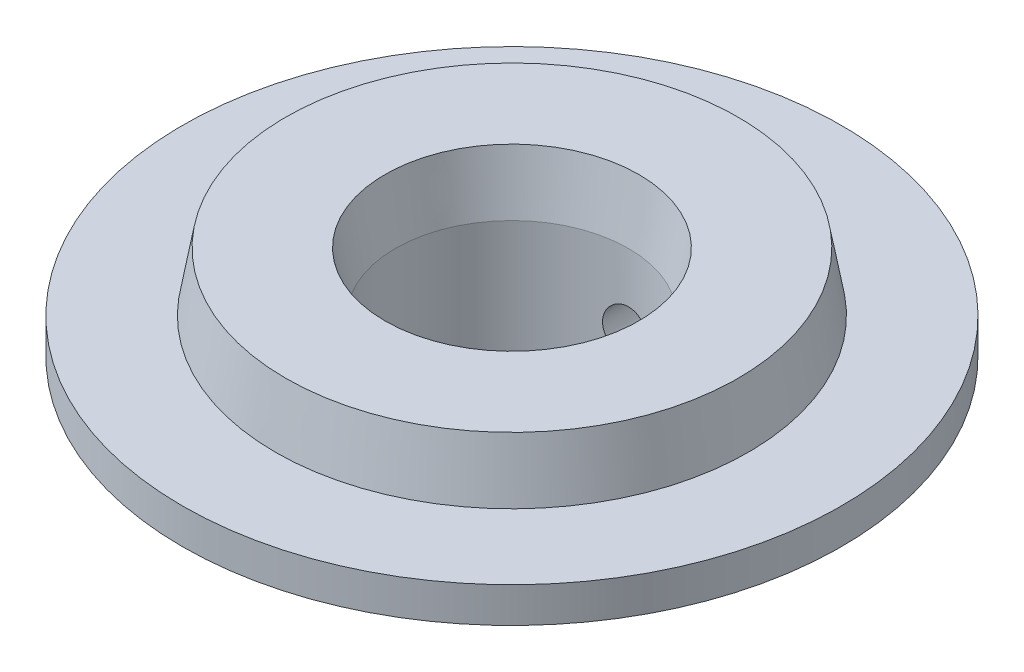
ISO-10303-21;
HEADER;
FILE_DESCRIPTION(('STEP AP214'),'2;1');
FILE_NAME('part.step','',(''),(''),'','','');
FILE_SCHEMA(('AUTOMOTIVE_DESIGN { 1 0 10303 214 1 1 1 1 }'));
ENDSEC;
DATA;
#1=APPLICATION_CONTEXT('core data for automotive mechanical design processes');
#2=APPLICATION_PROTOCOL_DEFINITION('international standard','automotive_design',2000,#1);
#3=PRODUCT_CONTEXT('',#1,'mechanical');
#4=PRODUCT('Part','Part','',(#3));
#5=PRODUCT_RELATED_PRODUCT_CATEGORY('part','',(#4));
#6=PRODUCT_DEFINITION_FORMATION('','',#4);
#7=PRODUCT_DEFINITION_CONTEXT('part definition',#1,'design');
#8=PRODUCT_DEFINITION('design','',#6,#7);
#9=PRODUCT_DEFINITION_SHAPE('','',#8);
#10=(LENGTH_UNIT() NAMED_UNIT(*) SI_UNIT(.MILLI.,.METRE.));
#11=(NAMED_UNIT(*) PLANE_ANGLE_UNIT() SI_UNIT($,.RADIAN.));
#12=(NAMED_UNIT(*) SI_UNIT($,.STERADIAN.) SOLID_ANGLE_UNIT());
#13=UNCERTAINTY_MEASURE_WITH_UNIT(LENGTH_MEASURE(1.E-05),#10,'distance_accuracy_value','');
#14=(GEOMETRIC_REPRESENTATION_CONTEXT(3) GLOBAL_UNCERTAINTY_ASSIGNED_CONTEXT((#13)) GLOBAL_UNIT_ASSIGNED_CONTEXT((#10,
#11,#12)) REPRESENTATION_CONTEXT('',''));
#15=CARTESIAN_POINT('',(0.,0.,0.));
#16=DIRECTION('',(0.,0.,1.));
#17=DIRECTION('',(1.,0.,0.));
#18=AXIS2_PLACEMENT_3D('',#15,#16,#17);
#19=CARTESIAN_POINT('',(0.,15.,0.));
#20=DIRECTION('',(0.,1.,0.));
#21=DIRECTION('',(0.,0.,1.));
#22=AXIS2_PLACEMENT_3D('',#19,#20,#21);
#23=PLANE('',#22);
#24=CARTESIAN_POINT('',(0.,15.,0.));
#25=DIRECTION('',(0.,1.,0.));
#26=DIRECTION('',(0.,0.,1.));
#27=AXIS2_PLACEMENT_3D('',#24,#25,#26);
#28=CIRCLE('',#27,19.2183650964577);
#29=CARTESIAN_POINT('',(0.,15.,19.2183650964577));
#30=VERTEX_POINT('',#29);
#31=EDGE_CURVE('E11',#30,#30,#28,.T.);
#32=ORIENTED_EDGE('',*,*,#31,.T.);
#33=EDGE_LOOP('',(#32));
#34=FACE_BOUND('',#33,.T.);
#35=CARTESIAN_POINT('',(0.,15.,0.));
#36=DIRECTION('',(0.,1.,0.));
#37=DIRECTION('',(0.,0.,1.));
#38=AXIS2_PLACEMENT_3D('',#35,#36,#37);
#39=CIRCLE('',#38,10.7816349035423);
#40=CARTESIAN_POINT('',(0.,15.,10.7816349035423));
#41=VERTEX_POINT('',#40);
#42=EDGE_CURVE('E45',#41,#41,#39,.T.);
#43=ORIENTED_EDGE('',*,*,#42,.F.);
#44=EDGE_LOOP('',(#43));
#45=FACE_BOUND('',#44,.T.);
#46=ADVANCED_FACE('F41',(#34,#45),#23,.T.);
#47=CARTESIAN_POINT('',(0.,10.,0.));
#48=DIRECTION('',(0.,1.,0.));
#49=DIRECTION('',(0.,0.,1.));
#50=AXIS2_PLACEMENT_3D('',#47,#48,#49);
#51=PLANE('',#50);
#52=CARTESIAN_POINT('',(0.,10.,0.));
#53=DIRECTION('',(0.,1.,0.));
#54=DIRECTION('',(0.,0.,1.));
#55=AXIS2_PLACEMENT_3D('',#52,#53,#54);
#56=CIRCLE('',#55,20.1);
#57=CARTESIAN_POINT('',(0.,10.,20.1));
#58=VERTEX_POINT('',#57);
#59=EDGE_CURVE('E49',#58,#58,#56,.T.);
#60=ORIENTED_EDGE('',*,*,#59,.F.);
#61=EDGE_LOOP('',(#60));
#62=FACE_BOUND('',#61,.T.);
#63=CARTESIAN_POINT('',(0.,10.,0.));
#64=DIRECTION('',(0.,1.,0.));
#65=DIRECTION('',(0.,0.,1.));
#66=AXIS2_PLACEMENT_3D('',#63,#64,#65);
#67=CIRCLE('',#66,9.9);
#68=CARTESIAN_POINT('',(0.,10.,9.9));
#69=VERTEX_POINT('',#68);
#70=EDGE_CURVE('E55',#69,#69,#67,.T.);
#71=ORIENTED_EDGE('',*,*,#70,.T.);
#72=EDGE_LOOP('',(#71));
#73=FACE_BOUND('',#72,.T.);
#74=ADVANCED_FACE('F65',(#62,#73),#51,.F.);
#75=CARTESIAN_POINT('',(0.,10.,0.));
#76=DIRECTION('',(0.,-1.,0.));
#77=DIRECTION('',(0.,0.,1.));
#78=AXIS2_PLACEMENT_3D('',#75,#76,#77);
#79=CONICAL_SURFACE('',#78,20.1,0.174532925199434);
#80=ORIENTED_EDGE('',*,*,#31,.F.);
#81=EDGE_LOOP('',(#80));
#82=FACE_BOUND('',#81,.T.);
#83=ORIENTED_EDGE('',*,*,#59,.T.);
#84=EDGE_LOOP('',(#83));
#85=FACE_BOUND('',#84,.T.);
#86=ADVANCED_FACE('F70',(#82,#85),#79,.T.);
#87=CARTESIAN_POINT('',(0.,10.,0.));
#88=DIRECTION('',(0.,1.,0.));
#89=DIRECTION('',(0.,0.,1.));
#90=AXIS2_PLACEMENT_3D('',#87,#88,#89);
#91=CONICAL_SURFACE('',#90,9.9,0.174532925199434);
#92=ORIENTED_EDGE('',*,*,#42,.T.);
#93=EDGE_LOOP('',(#92));
#94=FACE_BOUND('',#93,.T.);
#95=ORIENTED_EDGE('',*,*,#70,.F.);
#96=EDGE_LOOP('',(#95));
#97=FACE_BOUND('',#96,.T.);
#98=ADVANCED_FACE('F43',(#94,#97),#91,.F.);
#99=CLOSED_SHELL('',(#46,#74,#86,#98));
#100=MANIFOLD_SOLID_BREP('B2',#99);
#101=CARTESIAN_POINT('',(0.,7.,0.));
#102=DIRECTION('',(0.,-1.,0.));
#103=DIRECTION('',(0.,0.,-1.));
#104=AXIS2_PLACEMENT_3D('',#101,#102,#103);
#105=CYLINDRICAL_SURFACE('',#104,14.);
#106=CARTESIAN_POINT('',(0.,7.,0.));
#107=DIRECTION('',(0.,1.,0.));
#108=DIRECTION('',(0.,0.,1.));
#109=AXIS2_PLACEMENT_3D('',#106,#107,#108);
#110=CIRCLE('',#109,14.);
#111=CARTESIAN_POINT('',(0.,7.,14.));
#112=VERTEX_POINT('',#111);
#113=EDGE_CURVE('E40',#112,#112,#110,.T.);
#114=ORIENTED_EDGE('',*,*,#113,.F.);
#115=EDGE_LOOP('',(#114));
#116=FACE_BOUND('',#115,.T.);
#117=CARTESIAN_POINT('',(0.,0.,0.));
#118=DIRECTION('',(0.,1.,0.));
#119=DIRECTION('',(0.,0.,1.));
#120=AXIS2_PLACEMENT_3D('',#117,#118,#119);
#121=CIRCLE('',#120,14.);
#122=CARTESIAN_POINT('',(0.,0.,14.));
#123=VERTEX_POINT('',#122);
#124=EDGE_CURVE('E115',#123,#123,#121,.T.);
#125=ORIENTED_EDGE('',*,*,#124,.T.);
#126=EDGE_LOOP('',(#125));
#127=FACE_BOUND('',#126,.T.);
#128=CARTESIAN_POINT('',(-2.,3.70421529509385,13.856406460551));
#129=CARTESIAN_POINT('',(-1.99999534115949,3.59249112385413,13.8564082571265));
#130=CARTESIAN_POINT('',(-1.99060664506871,3.48070058232169,13.8577723197262));
#131=CARTESIAN_POINT('',(-1.95330740137887,3.26024065867055,13.8630779913067));
#132=CARTESIAN_POINT('',(-1.92537839621705,3.15157449957869,13.8670221688303));
#133=CARTESIAN_POINT('',(-1.85184738836467,2.94058659506499,13.8770324264324));
#134=CARTESIAN_POINT('',(-1.80625847122079,2.83826021699333,13.8830969350759));
#135=CARTESIAN_POINT('',(-1.69873175889211,2.64272556562579,13.8966626659811));
#136=CARTESIAN_POINT('',(-1.63679637900725,2.54951594805355,13.9041636759451));
#137=CARTESIAN_POINT('',(-1.49785346840196,2.37416699924652,13.9198182525555));
#138=CARTESIAN_POINT('',(-1.42075056427329,2.29210358122796,13.9279757447273));
#139=CARTESIAN_POINT('',(-1.25386707896715,2.14203373785326,13.9439890311844));
#140=CARTESIAN_POINT('',(-1.16408582185113,2.07402806245357,13.9518448093556));
#141=CARTESIAN_POINT('',(-0.973910384020492,1.95372619733416,13.9664103702289));
#142=CARTESIAN_POINT('',(-0.873471766216092,1.90149958057541,13.9731150229347));
#143=CARTESIAN_POINT('',(-0.665136745963096,1.81468455976602,13.9845795145291));
#144=CARTESIAN_POINT('',(-0.557240702039329,1.78009530844645,13.9893394468365));
#145=CARTESIAN_POINT('',(-0.337834063540951,1.72976608812958,13.9963505000898));
#146=CARTESIAN_POINT('',(-0.226353125069878,1.71389922512761,13.9986185031811));
#147=CARTESIAN_POINT('',(-0.00228956527839886,1.70107139652725,14.0004479548383));
#148=CARTESIAN_POINT('',(0.110292999940579,1.70410947312774,14.0000095405223));
#149=CARTESIAN_POINT('',(0.33249899218587,1.72890467330966,13.9964890946326));
#150=CARTESIAN_POINT('',(0.442137999771035,1.75052529397636,13.9934263413243));
#151=CARTESIAN_POINT('',(0.656215595128694,1.81165785479305,13.9850228541263));
#152=CARTESIAN_POINT('',(0.760654059261884,1.85117022008164,13.9796820661069));
#153=CARTESIAN_POINT('',(0.961781966767738,1.94710603987741,13.9672894037098));
#154=CARTESIAN_POINT('',(1.05844339279107,2.00358744621269,13.9602316817171));
#155=CARTESIAN_POINT('',(1.24096782013765,2.13181578783411,13.9451926669623));
#156=CARTESIAN_POINT('',(1.32683017541183,2.20356363573706,13.9372113189995));
#157=CARTESIAN_POINT('',(1.48612299106386,2.36104989676984,13.921132049438));
#158=CARTESIAN_POINT('',(1.55943569332184,2.44690742784304,13.9130337231123));
#159=CARTESIAN_POINT('',(1.69062989590123,2.62976981652333,13.8977029387566));
#160=CARTESIAN_POINT('',(1.74851131716179,2.72677473123946,13.8904704851631));
#161=CARTESIAN_POINT('',(1.84721301520795,2.92929558500002,13.8776905368292));
#162=CARTESIAN_POINT('',(1.88802200251778,3.03481710097645,13.8721441576987));
#163=CARTESIAN_POINT('',(1.9513062370832,3.25131287491973,13.8633846580895));
#164=CARTESIAN_POINT('',(1.97378265080303,3.36228678548541,13.8601713891613));
#165=CARTESIAN_POINT('',(1.99960390688194,3.58549183252389,13.8564698075732));
#166=CARTESIAN_POINT('',(2.00311531104472,3.69770332108943,13.8559577720311));
#167=CARTESIAN_POINT('',(1.99134808247121,3.921113100119,13.8576537253271));
#168=CARTESIAN_POINT('',(1.9760699768337,4.03231141891714,13.8598616378631));
#169=CARTESIAN_POINT('',(1.92729837855201,4.25002747512229,13.8667269652516));
#170=CARTESIAN_POINT('',(1.89388715844421,4.35656402215919,13.8713733134525));
#171=CARTESIAN_POINT('',(1.80988306171463,4.56252409255034,13.8825829121217));
#172=CARTESIAN_POINT('',(1.75928940970141,4.66194729465557,13.8891462490961));
#173=CARTESIAN_POINT('',(1.64195360331226,4.85160717481534,13.9035064841342));
#174=CARTESIAN_POINT('',(1.57510320027125,4.9417762563062,13.911311524523));
#175=CARTESIAN_POINT('',(1.42730277821365,5.10967501871936,13.9272509086593));
#176=CARTESIAN_POINT('',(1.34635203820216,5.18740406315297,13.9353852692295));
#177=CARTESIAN_POINT('',(1.17191708628535,5.32881051352764,13.9511405241391));
#178=CARTESIAN_POINT('',(1.07834317212433,5.39237781741337,13.9587570956185));
#179=CARTESIAN_POINT('',(0.881748704771194,5.50289085822957,13.972552215598));
#180=CARTESIAN_POINT('',(0.778728390176454,5.5498370148318,13.9787308004049));
#181=CARTESIAN_POINT('',(0.566515924593931,5.62559740940956,13.9889347784444));
#182=CARTESIAN_POINT('',(0.457345999123929,5.65447288372133,13.9929674365722));
#183=CARTESIAN_POINT('',(0.235645259045785,5.69347076220046,13.9984555911653));
#184=CARTESIAN_POINT('',(0.123114645314278,5.7035942849477,13.9999112413524));
#185=CARTESIAN_POINT('',(-0.101043130627157,5.70477553403832,14.0000800767192));
#186=CARTESIAN_POINT('',(-0.212669421750584,5.69600211411228,13.998817550224));
#187=CARTESIAN_POINT('',(-0.432842633479872,5.65999914505081,13.9937406427504));
#188=CARTESIAN_POINT('',(-0.541389561355442,5.63276963948997,13.989926267797));
#189=CARTESIAN_POINT('',(-0.752283714497251,5.56068531766565,13.9801722205426));
#190=CARTESIAN_POINT('',(-0.854634630206984,5.51584111460911,13.9742338281967));
#191=CARTESIAN_POINT('',(-1.05038570585148,5.40981814589182,13.9608856010229));
#192=CARTESIAN_POINT('',(-1.14378562996655,5.34863895003574,13.9534757274438));
#193=CARTESIAN_POINT('',(-1.31984194960265,5.21106757987047,13.9379304746346));
#194=CARTESIAN_POINT('',(-1.40240016631986,5.13455038826135,13.9297894585903));
#195=CARTESIAN_POINT('',(-1.55356716727243,4.96873773485855,13.9137422342621));
#196=CARTESIAN_POINT('',(-1.6221726663073,4.87943927209731,13.9058360816507));
#197=CARTESIAN_POINT('',(-1.74379523475593,4.6900698567582,13.8911108785174));
#198=CARTESIAN_POINT('',(-1.79673154300995,4.58994660468272,13.8842975402726));
#199=CARTESIAN_POINT('',(-1.88495902507096,4.38218299848932,13.8725962813595));
#200=CARTESIAN_POINT('',(-1.92026877922144,4.27455069677665,13.8677063343816));
#201=CARTESIAN_POINT('',(-1.96409255165575,4.08937886926331,13.8615529221772));
#202=CARTESIAN_POINT('',(-1.97753762529532,4.01299095968328,13.859633039894));
#203=CARTESIAN_POINT('',(-1.99549291508544,3.85915109812801,13.857059193163));
#204=CARTESIAN_POINT('',(-2.00000323103726,3.78169915804772,13.8564052145753));
#205=CARTESIAN_POINT('',(-2.,3.70421529509385,13.856406460551));
#206=B_SPLINE_CURVE_WITH_KNOTS('',3,(#128,#129,#130,#131,#132,#133,#134,#135,#136,#137,#138,
#139,#140,#141,#142,#143,#144,#145,#146,#147,#148,#149,#150,#151,#152,#153,#154,#155,#156,#157,
#158,#159,#160,#161,#162,#163,#164,#165,#166,#167,#168,#169,#170,#171,#172,#173,#174,#175,#176,
#177,#178,#179,#180,#181,#182,#183,#184,#185,#186,#187,#188,#189,#190,#191,#192,#193,#194,#195,
#196,#197,#198,#199,#200,#201,#202,#203,#204,#205),.UNSPECIFIED.,.T.,.F.,(4,2,2,2,2,2,2,2,2,2,2,
2,2,2,2,2,2,2,2,2,2,2,2,2,2,2,2,2,2,2,2,2,2,2,2,2,2,2,4),(0.,0.334889349408973,
0.670112594526281,1.00508792139358,1.34001378108308,1.6771171564902,2.01423851114537,
2.35282530676003,2.6913958357102,3.02765822138618,3.36390357078099,3.69769984907442,
4.03150405935711,4.36646147641386,4.70143892261039,5.03940517986243,5.37737316862278,
5.7155642933107,6.05373389790875,6.3889286108256,6.72411392079905,7.05779100804299,
7.39148315513125,7.72746121011463,8.06345644976601,8.40197921522166,8.74049343261658,
9.07785422138908,9.41519488547502,9.74953375304066,10.083871831239,10.4180087723112,
10.7521545140199,11.0891434930866,11.426211725383,11.7649881551454,12.103406718889,
12.3356645196522,12.5679197260806),.UNSPECIFIED.);
#207=CARTESIAN_POINT('',(-2.,3.70421529509385,13.856406460551));
#208=VERTEX_POINT('',#207);
#209=EDGE_CURVE('E144',#208,#208,#206,.T.);
#210=ORIENTED_EDGE('',*,*,#209,.F.);
#211=EDGE_LOOP('',(#210));
#212=FACE_BOUND('',#211,.T.);
#213=CARTESIAN_POINT('',(0.,5.70421529509385,-14.));
#214=CARTESIAN_POINT('',(0.111730729412821,5.70421064191622,-13.9999982704576));
#215=CARTESIAN_POINT('',(0.223527810991034,5.69482088077504,-13.9986484040059));
#216=CARTESIAN_POINT('',(0.444001320736162,5.65751702262586,-13.9933934101175));
#217=CARTESIAN_POINT('',(0.552674531066957,5.62958449155308,-13.9894857399261));
#218=CARTESIAN_POINT('',(0.763677353570884,5.55604317162539,-13.9795546032365));
#219=CARTESIAN_POINT('',(0.866011538699541,5.51044730144084,-13.9735326833659));
#220=CARTESIAN_POINT('',(1.06155930048063,5.40290420930313,-13.9600397816117));
#221=CARTESIAN_POINT('',(1.1547742308773,5.34095941939468,-13.9525690153005));
#222=CARTESIAN_POINT('',(1.33011730079462,5.20200695275931,-13.9369507824178));
#223=CARTESIAN_POINT('',(1.4121711816013,5.12490600937802,-13.9287993153496));
#224=CARTESIAN_POINT('',(1.56222258353725,4.95803046601453,-13.9127699964244));
#225=CARTESIAN_POINT('',(1.63021932541739,4.8682551639008,-13.9048921597561));
#226=CARTESIAN_POINT('',(1.75051175284446,4.67808506298634,-13.8902631298137));
#227=CARTESIAN_POINT('',(1.80273625094777,4.57764480252354,-13.8835171039926));
#228=CARTESIAN_POINT('',(1.8895469033362,4.36930621611174,-13.8719696531257));
#229=CARTESIAN_POINT('',(1.92413392908997,4.2614082589472,-13.8671681320043));
#230=CARTESIAN_POINT('',(1.97445864012233,4.04199527543781,-13.8600923875319));
#231=CARTESIAN_POINT('',(1.99032297705591,3.9305098552382,-13.8578011904721));
#232=CARTESIAN_POINT('',(2.00314420015137,3.70643748422425,-13.8559538769084));
#233=CARTESIAN_POINT('',(2.00010207253958,3.5938505911724,-13.8563976177408));
#234=CARTESIAN_POINT('',(1.97530036195882,3.3716622044277,-13.8599545154206));
#235=CARTESIAN_POINT('',(1.95368136359299,3.26204465100214,-13.8630476220424));
#236=CARTESIAN_POINT('',(1.89255944642857,3.04800912252532,-13.8715234337902));
#237=CARTESIAN_POINT('',(1.85305606494963,2.94359128207152,-13.8769061981508));
#238=CARTESIAN_POINT('',(1.75713904249907,2.74248874887699,-13.8893771547056));
#239=CARTESIAN_POINT('',(1.70066538623268,2.64583307032224,-13.8964713816251));
#240=CARTESIAN_POINT('',(1.57245369144076,2.46331687071525,-13.9115614778013));
#241=CARTESIAN_POINT('',(1.50071474302511,2.37745699363396,-13.9195574007903));
#242=CARTESIAN_POINT('',(1.34323491742878,2.21815448886458,-13.935638713609));
#243=CARTESIAN_POINT('',(1.25737307515522,2.14483140497393,-13.9437242576907));
#244=CARTESIAN_POINT('',(1.07449831880178,2.01361829264732,-13.9590063579119));
#245=CARTESIAN_POINT('',(0.977485363744979,1.95572832092591,-13.9662029107845));
#246=CARTESIAN_POINT('',(0.774962079627688,1.85702042009526,-13.9789027062694));
#247=CARTESIAN_POINT('',(0.669447455467309,1.81621118559958,-13.9844050861204));
#248=CARTESIAN_POINT('',(0.452966698754194,1.75292435645435,-13.9930891989204));
#249=CARTESIAN_POINT('',(0.342000900631282,1.73044563871203,-13.9962710740431));
#250=CARTESIAN_POINT('',(0.118800022389945,1.70461566827342,-13.9999369457274));
#251=CARTESIAN_POINT('',(0.00658433954239075,1.70109996862535,-14.0004441362448));
#252=CARTESIAN_POINT('',(-0.216834850313296,1.71286010311393,-13.998766472677));
#253=CARTESIAN_POINT('',(-0.328038385576058,1.72813541105893,-13.9965816939732));
#254=CARTESIAN_POINT('',(-0.545782417984487,1.77690723668856,-13.989779937323));
#255=CARTESIAN_POINT('',(-0.652341104920122,1.8103241542734,-13.9851735873009));
#256=CARTESIAN_POINT('',(-0.858342944024681,1.89434703438926,-13.9740437427243));
#257=CARTESIAN_POINT('',(-0.95778578908108,1.94495373827298,-13.9675201654863));
#258=CARTESIAN_POINT('',(-1.14745969579786,2.06230911208131,-13.9532237717093));
#259=CARTESIAN_POINT('',(-1.23762521269797,2.1291627247993,-13.9454429484921));
#260=CARTESIAN_POINT('',(-1.40551529480486,2.27696737114611,-13.9295244643077));
#261=CARTESIAN_POINT('',(-1.48323920707858,2.35791914417852,-13.9213867846415));
#262=CARTESIAN_POINT('',(-1.62463364620767,2.53235199605831,-13.905598801697));
#263=CARTESIAN_POINT('',(-1.68819430084838,2.62592256539437,-13.8979526154851));
#264=CARTESIAN_POINT('',(-1.79869568753914,2.82250848169784,-13.8840847148081));
#265=CARTESIAN_POINT('',(-1.84563683505083,2.92552359248546,-13.8778629647358));
#266=CARTESIAN_POINT('',(-1.92139410758533,3.13773859960014,-13.8675777026176));
#267=CARTESIAN_POINT('',(-1.9502693013197,3.24691705393516,-13.8635071637923));
#268=CARTESIAN_POINT('',(-1.98926373200153,3.46863585614945,-13.8579660926443));
#269=CARTESIAN_POINT('',(-1.99938413393019,3.58117599477153,-13.8564953988287));
#270=CARTESIAN_POINT('',(-2.00055590374211,3.80532912161514,-13.8563261774508));
#271=CARTESIAN_POINT('',(-1.99177997367806,3.91694122674916,-13.8576025432318));
#272=CARTESIAN_POINT('',(-1.955776958508,4.13708541915231,-13.8627292421198));
#273=CARTESIAN_POINT('',(-1.92854989241351,4.24561750959487,-13.8665795725747));
#274=CARTESIAN_POINT('',(-1.85647645565796,4.45648056020503,-13.8764118947751));
#275=CARTESIAN_POINT('',(-1.81164102962601,4.55881532685689,-13.8823925621769));
#276=CARTESIAN_POINT('',(-1.70564064203087,4.75453774004725,-13.8958134572738));
#277=CARTESIAN_POINT('',(-1.64447523191839,4.84792514072524,-13.9032537250596));
#278=CARTESIAN_POINT('',(-1.50691947463095,5.02398111362276,-13.9188366265289));
#279=CARTESIAN_POINT('',(-1.43040092940365,5.10654904029608,-13.9269848226365));
#280=CARTESIAN_POINT('',(-1.26458151332115,5.25773500252608,-13.9430182205406));
#281=CARTESIAN_POINT('',(-1.17527766433494,5.32634977888234,-13.9509033605333));
#282=CARTESIAN_POINT('',(-0.985903424533845,5.44798286712999,-13.9655666249256));
#283=CARTESIAN_POINT('',(-0.885781717454296,5.50092194925174,-13.9723390511953));
#284=CARTESIAN_POINT('',(-0.678021288370035,5.58915503909994,-13.9839575607488));
#285=CARTESIAN_POINT('',(-0.57039060519898,5.62446759652623,-13.9888056680308));
#286=CARTESIAN_POINT('',(-0.385211363997557,5.66829888200647,-13.9949036300505));
#287=CARTESIAN_POINT('',(-0.308813899178573,5.68174733203209,-13.9968051085646));
#288=CARTESIAN_POINT('',(-0.154954921365663,5.69970710418205,-13.9993538865779));
#289=CARTESIAN_POINT('',(-0.0774934198230615,5.70421852241232,-14.0000011995639));
#290=CARTESIAN_POINT('',(0.,5.70421529509385,-14.));
#291=B_SPLINE_CURVE_WITH_KNOTS('',3,(#213,#214,#215,#216,#217,#218,#219,#220,#221,#222,#223,
#224,#225,#226,#227,#228,#229,#230,#231,#232,#233,#234,#235,#236,#237,#238,#239,#240,#241,#242,
#243,#244,#245,#246,#247,#248,#249,#250,#251,#252,#253,#254,#255,#256,#257,#258,#259,#260,#261,
#262,#263,#264,#265,#266,#267,#268,#269,#270,#271,#272,#273,#274,#275,#276,#277,#278,#279,#280,
#281,#282,#283,#284,#285,#286,#287,#288,#289,#290),.UNSPECIFIED.,.T.,.F.,(4,2,2,2,2,2,2,2,2,2,2,
2,2,2,2,2,2,2,2,2,2,2,2,2,2,2,2,2,2,2,2,2,2,2,2,2,2,2,4),(0.,0.334909053352877,
0.670151551991671,1.0051493213937,1.34009728501034,1.67717486857613,2.01427113282988,
2.35286688085115,2.69144589721316,3.02772118641954,3.36397893449559,3.69771416579721,
4.03145803153491,4.36639635621899,4.70135465054929,5.03934756706697,5.3773417256446,
5.71550772487662,6.05365300345249,6.38886112086085,6.7240598518806,7.0577995773694,
7.39155369804991,7.7275237598663,8.06351144755165,8.40202124724692,8.74052258413026,
9.07791128740849,9.41527903259352,9.74957651847121,10.0838736598988,10.4179633440508,
10.7520622058671,11.0890764750947,11.4261693744911,11.7649380499931,12.1033494584613,
12.3356358411576,12.5679197259081),.UNSPECIFIED.);
#292=CARTESIAN_POINT('',(0.,5.70421529509385,-14.));
#293=VERTEX_POINT('',#292);
#294=EDGE_CURVE('E148',#293,#293,#291,.T.);
#295=ORIENTED_EDGE('',*,*,#294,.F.);
#296=EDGE_LOOP('',(#295));
#297=FACE_BOUND('',#296,.T.);
#298=ADVANCED_FACE('F103',(#116,#127,#212,#297),#105,.T.);
#299=CARTESIAN_POINT('',(0.,7.,0.));
#300=DIRECTION('',(0.,-1.,0.));
#301=DIRECTION('',(0.,0.,-1.));
#302=AXIS2_PLACEMENT_3D('',#299,#300,#301);
#303=CYLINDRICAL_SURFACE('',#302,9.9);
#304=CARTESIAN_POINT('',(-2.,3.70421529509385,9.69587541174081));
#305=CARTESIAN_POINT('',(-1.99999592018529,3.59311130109733,9.6958776277667));
#306=CARTESIAN_POINT('',(-1.99071047875259,3.48195617240582,9.69780587171778));
#307=CARTESIAN_POINT('',(-1.95384600519318,3.26279213692803,9.70529888303462));
#308=CARTESIAN_POINT('',(-1.92625248235249,3.15478579312983,9.71086653091054));
#309=CARTESIAN_POINT('',(-1.85366383890559,2.94512172858348,9.72498263046161));
#310=CARTESIAN_POINT('',(-1.80868621099076,2.84345774491244,9.73352808488194));
#311=CARTESIAN_POINT('',(-1.70265422983805,2.64912099602916,9.75263337169193));
#312=CARTESIAN_POINT('',(-1.64160071454789,2.55644776252293,9.76319309908069));
#313=CARTESIAN_POINT('',(-1.50421117402995,2.38138177017187,9.78530730427603));
#314=CARTESIAN_POINT('',(-1.42768757819982,2.29913759331982,9.79687288799203));
#315=CARTESIAN_POINT('',(-1.26193532494346,2.14856189812833,9.81959796286526));
#316=CARTESIAN_POINT('',(-1.17270576795556,2.08023136568561,9.83075742519945));
#317=CARTESIAN_POINT('',(-0.983089292912225,1.95884489348067,9.85153279000058));
#318=CARTESIAN_POINT('',(-0.882610131562033,1.90593032841645,9.86113406890384));
#319=CARTESIAN_POINT('',(-0.673960753708159,1.81779035734855,9.87758643382202));
#320=CARTESIAN_POINT('',(-0.565791273007477,1.78256326161662,9.88443778253212));
#321=CARTESIAN_POINT('',(-0.346374079338975,1.73126122598275,9.89453986311899));
#322=CARTESIAN_POINT('',(-0.235187249950619,1.71493532613934,9.89783773434469));
#323=CARTESIAN_POINT('',(-0.0116071527000566,1.70111595800708,9.9006241383359));
#324=CARTESIAN_POINT('',(0.100785995563753,1.70362063970402,9.90011304531391));
#325=CARTESIAN_POINT('',(0.321863245316219,1.72720134824327,9.89537558239928));
#326=CARTESIAN_POINT('',(0.430577510035475,1.74800703311349,9.89120329768731));
#327=CARTESIAN_POINT('',(0.642939200720462,1.8071701431566,9.87967331094506));
#328=CARTESIAN_POINT('',(0.746586420874945,1.84552828061369,9.87231547964493));
#329=CARTESIAN_POINT('',(0.946640926094763,1.93895671607052,9.85515221640425));
#330=CARTESIAN_POINT('',(1.04299754114283,1.99413256932811,9.84533139673847));
#331=CARTESIAN_POINT('',(1.22518429491766,2.11955202772413,9.82432419670345));
#332=CARTESIAN_POINT('',(1.31101319717006,2.18979740011139,9.81313765623828));
#333=CARTESIAN_POINT('',(1.47131287420088,2.34484380293627,9.79039937397518));
#334=CARTESIAN_POINT('',(1.54555456159348,2.42988143221197,9.77884467529636));
#335=CARTESIAN_POINT('',(1.67876116934,2.61131700475223,9.75686079122205));
#336=CARTESIAN_POINT('',(1.7377257889031,2.70771517164054,9.74643162798963));
#337=CARTESIAN_POINT('',(1.8387858216122,2.90946871510514,9.72787361689993));
#338=CARTESIAN_POINT('',(1.8808435079247,3.01484349492357,9.71974992530551));
#339=CARTESIAN_POINT('',(1.94658939191751,3.23136620479112,9.70679782319806));
#340=CARTESIAN_POINT('',(1.97028003676764,3.34251336363939,9.70196897370039));
#341=CARTESIAN_POINT('',(1.99827562244262,3.56534769729973,9.69624140665876));
#342=CARTESIAN_POINT('',(2.00291166915164,3.67699159490879,9.6952755707618));
#343=CARTESIAN_POINT('',(1.993557998256,3.89945743962782,9.69720313203306));
#344=CARTESIAN_POINT('',(1.97956935968358,4.01027943398119,9.70009630562729));
#345=CARTESIAN_POINT('',(1.93364904636158,4.22683857985928,9.70935298949848));
#346=CARTESIAN_POINT('',(1.90189485059604,4.33261496643908,9.71568215574038));
#347=CARTESIAN_POINT('',(1.82153482484969,4.53734614086128,9.73106748181289));
#348=CARTESIAN_POINT('',(1.77292758272024,4.6363003562278,9.74012387015424));
#349=CARTESIAN_POINT('',(1.65949382218771,4.82602541952583,9.76009365552808));
#350=CARTESIAN_POINT('',(1.59446045680174,4.91667012116628,9.77103011942079));
#351=CARTESIAN_POINT('',(1.45029570300549,5.08588072988578,9.7934647610863));
#352=CARTESIAN_POINT('',(1.37116283271136,5.16444536570921,9.80496299781015));
#353=CARTESIAN_POINT('',(1.19955772100275,5.30852414668178,9.82744381316059));
#354=CARTESIAN_POINT('',(1.10689568965142,5.37381422344646,9.83841547247219));
#355=CARTESIAN_POINT('',(0.911725867168155,5.48789987819968,9.85841592283258));
#356=CARTESIAN_POINT('',(0.809218495094146,5.53669615783242,9.86744479652129));
#357=CARTESIAN_POINT('',(0.59785183322719,5.61608398123626,9.88249580066296));
#358=CARTESIAN_POINT('',(0.489033115904148,5.6467801325085,9.88853517533388));
#359=CARTESIAN_POINT('',(0.267649657329677,5.68942733290362,9.89700073310942));
#360=CARTESIAN_POINT('',(0.155085378607642,5.70138068781624,9.89942736066215));
#361=CARTESIAN_POINT('',(-0.0684550706422229,5.70611218367446,9.90038322061505));
#362=CARTESIAN_POINT('',(-0.179423960753505,5.69922695407306,9.89898087444713));
#363=CARTESIAN_POINT('',(-0.39858856975431,5.66722100780299,9.89258049687959));
#364=CARTESIAN_POINT('',(-0.506784324957908,5.64210053005051,9.88758251258962));
#365=CARTESIAN_POINT('',(-0.717116354747767,5.57448803802736,9.87455469823892));
#366=CARTESIAN_POINT('',(-0.819266351075379,5.53203723606861,9.86653206437354));
#367=CARTESIAN_POINT('',(-1.01504164431845,5.43101206482203,9.84831802847681));
#368=CARTESIAN_POINT('',(-1.1086662501319,5.3724363899337,9.83812645084535));
#369=CARTESIAN_POINT('',(-1.28639527756209,5.23969261698132,9.81648325703708));
#370=CARTESIAN_POINT('',(-1.37031797180482,5.16528410717982,9.80501368685482));
#371=CARTESIAN_POINT('',(-1.52460163764702,5.00347987869491,9.7822127748547));
#372=CARTESIAN_POINT('',(-1.59495938787409,4.91608108381301,9.77088146646793));
#373=CARTESIAN_POINT('',(-1.72085454071858,4.72962006497517,9.74950220665768));
#374=CARTESIAN_POINT('',(-1.77621986904235,4.63043979901801,9.73946979355352));
#375=CARTESIAN_POINT('',(-1.86941128934392,4.42400825470294,9.72201456457888));
#376=CARTESIAN_POINT('',(-1.90725318237173,4.31676434925173,9.71458939919445));
#377=CARTESIAN_POINT('',(-1.95704552952198,4.12511173698509,9.70466028404397));
#378=CARTESIAN_POINT('',(-1.97312442325752,4.04179089349112,9.70138652216266));
#379=CARTESIAN_POINT('',(-1.99460302376302,3.87372835383667,9.69699327916978));
#380=CARTESIAN_POINT('',(-2.00000311286433,3.78898670865445,9.69587372093168));
#381=CARTESIAN_POINT('',(-2.,3.70421529509385,9.69587541174081));
#382=B_SPLINE_CURVE_WITH_KNOTS('',3,(#304,#305,#306,#307,#308,#309,#310,#311,#312,#313,#314,
#315,#316,#317,#318,#319,#320,#321,#322,#323,#324,#325,#326,#327,#328,#329,#330,#331,#332,#333,
#334,#335,#336,#337,#338,#339,#340,#341,#342,#343,#344,#345,#346,#347,#348,#349,#350,#351,#352,
#353,#354,#355,#356,#357,#358,#359,#360,#361,#362,#363,#364,#365,#366,#367,#368,#369,#370,#371,
#372,#373,#374,#375,#376,#377,#378,#379,#380,#381),.UNSPECIFIED.,.T.,.F.,(4,2,2,2,2,2,2,2,2,2,2,
2,2,2,2,2,2,2,2,2,2,2,2,2,2,2,2,2,2,2,2,2,2,2,2,2,2,2,4),(0.,0.333001564478879,
0.666267012204913,0.999197982217325,1.33211160180073,1.66933404552077,2.00658037592999,
2.34682857418292,2.68704426148554,3.02268897926609,3.3583007219961,3.68903653847444,
4.01978577750939,4.3526552490927,4.68556377866259,5.02439158188934,5.36322605580395,
5.70281247709307,6.04235364512119,6.37596910241443,6.70956523233821,7.03988674086974,
7.37023593435724,7.70497276902836,8.03974480593019,8.37976867063002,8.71977806893362,
9.0578026593403,9.39578566177987,9.72776882678017,10.0597476422527,10.3909415532496,
10.7221622882835,11.0588259597709,11.3955694831778,11.7360282352381,12.0761793916916,
12.3302658836002,12.5843432783305),.UNSPECIFIED.);
#383=CARTESIAN_POINT('',(-2.,3.70421529509385,9.69587541174081));
#384=VERTEX_POINT('',#383);
#385=EDGE_CURVE('E124',#384,#384,#382,.T.);
#386=ORIENTED_EDGE('',*,*,#385,.T.);
#387=EDGE_LOOP('',(#386));
#388=FACE_BOUND('',#387,.T.);
#389=CARTESIAN_POINT('',(0.,0.,0.));
#390=DIRECTION('',(0.,1.,0.));
#391=DIRECTION('',(0.,0.,1.));
#392=AXIS2_PLACEMENT_3D('',#389,#390,#391);
#393=CIRCLE('',#392,9.9);
#394=CARTESIAN_POINT('',(0.,0.,9.9));
#395=VERTEX_POINT('',#394);
#396=EDGE_CURVE('E120',#395,#395,#393,.T.);
#397=ORIENTED_EDGE('',*,*,#396,.F.);
#398=EDGE_LOOP('',(#397));
#399=FACE_BOUND('',#398,.T.);
#400=CARTESIAN_POINT('',(0.,10.,0.));
#401=DIRECTION('',(0.,1.,0.));
#402=DIRECTION('',(0.,0.,1.));
#403=AXIS2_PLACEMENT_3D('',#400,#401,#402);
#404=CIRCLE('',#403,9.9);
#405=CARTESIAN_POINT('',(0.,10.,9.9));
#406=VERTEX_POINT('',#405);
#407=EDGE_CURVE('E153',#406,#406,#404,.T.);
#408=ORIENTED_EDGE('',*,*,#407,.T.);
#409=EDGE_LOOP('',(#408));
#410=FACE_BOUND('',#409,.T.);
#411=CARTESIAN_POINT('',(0.,5.70421529509385,-9.9));
#412=CARTESIAN_POINT('',(0.111130079240346,5.70421123518585,-9.89999794873475));
#413=CARTESIAN_POINT('',(0.222311240366736,5.69492158088122,-9.89810961851837));
#414=CARTESIAN_POINT('',(0.441529326360832,5.65803885790475,-9.89075886218937));
#415=CARTESIAN_POINT('',(0.549563709610931,5.63043139988889,-9.88529362632482));
#416=CARTESIAN_POINT('',(0.759287161938678,5.55780201738133,-9.87139914846748));
#417=CARTESIAN_POINT('',(0.860982256303169,5.5127969311385,-9.86297277312075));
#418=CARTESIAN_POINT('',(1.05537146936786,5.40670022033079,-9.84407135828083));
#419=CARTESIAN_POINT('',(1.14806609185545,5.34560949684571,-9.83359643355105));
#420=CARTESIAN_POINT('',(1.32310933498304,5.2081817819411,-9.81158856080561));
#421=CARTESIAN_POINT('',(1.40531582404979,5.13166557721584,-9.80004412992492));
#422=CARTESIAN_POINT('',(1.55581838078665,4.96594411097771,-9.77728163815926));
#423=CARTESIAN_POINT('',(1.6241133468288,4.87673784551148,-9.76606360318124));
#424=CARTESIAN_POINT('',(1.74546148186851,4.68714316500761,-9.74511181122465));
#425=CARTESIAN_POINT('',(1.79836705034819,4.58665850316525,-9.7353928226377));
#426=CARTESIAN_POINT('',(1.88648888935806,4.37799723278058,-9.71870280579751));
#427=CARTESIAN_POINT('',(1.92170694501402,4.26982140173392,-9.71173150024754));
#428=CARTESIAN_POINT('',(1.97299176483365,4.05037904029653,-9.70144242619886));
#429=CARTESIAN_POINT('',(1.98930813985776,3.93917312162373,-9.69807708396044));
#430=CARTESIAN_POINT('',(2.00310183614184,3.71555522349348,-9.69523781131829));
#431=CARTESIAN_POINT('',(2.00058112371713,3.60314337114099,-9.69576347475065));
#432=CARTESIAN_POINT('',(1.97697391401865,3.38213380268791,-9.70060361201543));
#433=CARTESIAN_POINT('',(1.95617395431279,3.27350400798086,-9.70485960805838));
#434=CARTESIAN_POINT('',(1.89705114665957,3.06130825085369,-9.71658875046782));
#435=CARTESIAN_POINT('',(1.8587274465586,2.9577425349634,-9.72406205328615));
#436=CARTESIAN_POINT('',(1.76537252112319,2.75779112557085,-9.74144331826127));
#437=CARTESIAN_POINT('',(1.7102280769786,2.66145977808755,-9.75136768938931));
#438=CARTESIAN_POINT('',(1.58487686712571,2.47931047420948,-9.77252237921343));
#439=CARTESIAN_POINT('',(1.51466833668688,2.39349375143608,-9.78375285084617));
#440=CARTESIAN_POINT('',(1.35964955935746,2.23315670937707,-9.80650743709023));
#441=CARTESIAN_POINT('',(1.27459484824358,2.15887277198516,-9.81803315688393));
#442=CARTESIAN_POINT('',(1.09310954967438,2.02558885369873,-9.83989084050928));
#443=CARTESIAN_POINT('',(0.996678810613359,1.96658907652618,-9.85022278842817));
#444=CARTESIAN_POINT('',(0.794913508347829,1.86550302453123,-9.86855498677595));
#445=CARTESIAN_POINT('',(0.689564836031215,1.8234441809782,-9.87655144980896));
#446=CARTESIAN_POINT('',(0.473099287339953,1.75768812750467,-9.8892830163002));
#447=CARTESIAN_POINT('',(0.361983125977973,1.73398864729333,-9.89401852299526));
#448=CARTESIAN_POINT('',(0.139167710587478,1.70595967214429,-9.89963832763082));
#449=CARTESIAN_POINT('',(0.0275107143469118,1.70130674769966,-9.90058692413409));
#450=CARTESIAN_POINT('',(-0.194985259249762,1.71063134569066,-9.89870478736331));
#451=CARTESIAN_POINT('',(-0.305824283199972,1.72460779857578,-9.89587427105582));
#452=CARTESIAN_POINT('',(-0.522491663294704,1.77052575548043,-9.88679222059324));
#453=CARTESIAN_POINT('',(-0.628356715646987,1.80230092388284,-9.8805723753963));
#454=CARTESIAN_POINT('',(-0.833256035618271,1.88273227068334,-9.86540666259902));
#455=CARTESIAN_POINT('',(-0.932289783091514,1.93138973282736,-9.85646058769983));
#456=CARTESIAN_POINT('',(-1.12207655472062,2.04490146139559,-9.83667478004768));
#457=CARTESIAN_POINT('',(-1.21271104391283,2.10994996076339,-9.82581284400767));
#458=CARTESIAN_POINT('',(-1.38189409968591,2.25413765443396,-9.80345163928853));
#459=CARTESIAN_POINT('',(-1.46044134051804,2.33327839234544,-9.79195230088596));
#460=CARTESIAN_POINT('',(-1.60447168569658,2.50487768586664,-9.76939504048443));
#461=CARTESIAN_POINT('',(-1.66973254462338,2.5975242707431,-9.75834676849929));
#462=CARTESIAN_POINT('',(-1.78376698714831,2.7926543569278,-9.73814883953189));
#463=CARTESIAN_POINT('',(-1.83254123727214,2.89513746034711,-9.72899910580072));
#464=CARTESIAN_POINT('',(-1.91191650355344,3.10651077086866,-9.7137125403124));
#465=CARTESIAN_POINT('',(-1.94261272368261,3.21536403293925,-9.70755995492926));
#466=CARTESIAN_POINT('',(-1.98524839854114,3.43682122303668,-9.69893140859767));
#467=CARTESIAN_POINT('',(-1.99719035545276,3.54942464867146,-9.69645495718411));
#468=CARTESIAN_POINT('',(-2.00188444506327,3.77295344793606,-9.69548668937201));
#469=CARTESIAN_POINT('',(-1.99498787929538,3.88387127693369,-9.69692192652396));
#470=CARTESIAN_POINT('',(-1.96297706580163,4.10293072799967,-9.70345212978097));
#471=CARTESIAN_POINT('',(-1.93786297105927,4.2110723733734,-9.70854706515336));
#472=CARTESIAN_POINT('',(-1.87028809179477,4.4212804156673,-9.72178966747776));
#473=CARTESIAN_POINT('',(-1.82787122516627,4.52336144963355,-9.72992960130718));
#474=CARTESIAN_POINT('',(-1.72693553396546,4.71901267995579,-9.74834929898441));
#475=CARTESIAN_POINT('',(-1.66841532433099,4.81258214330284,-9.75862924687812));
#476=CARTESIAN_POINT('',(-1.53573785541089,4.99030162496306,-9.78039333103806));
#477=CARTESIAN_POINT('',(-1.46132723602096,5.07426035353331,-9.79189524511793));
#478=CARTESIAN_POINT('',(-1.29950329556555,5.22861574077065,-9.81468055918018));
#479=CARTESIAN_POINT('',(-1.21208698940656,5.29900927738939,-9.82596390832334));
#480=CARTESIAN_POINT('',(-1.02560690081751,5.42494955538525,-9.84718344695619));
#481=CARTESIAN_POINT('',(-0.926428331846442,5.48032909757106,-9.8571039028901));
#482=CARTESIAN_POINT('',(-0.719999055143606,5.57354754107852,-9.87432475643343));
#483=CARTESIAN_POINT('',(-0.61275567161141,5.61140213959942,-9.88162749741734));
#484=CARTESIAN_POINT('',(-0.421070551191568,5.66122504244836,-9.89138330994908));
#485=CARTESIAN_POINT('',(-0.337714728260591,5.67731743910612,-9.89459554562243));
#486=CARTESIAN_POINT('',(-0.169582488205116,5.69881393796091,-9.89890463838643));
#487=CARTESIAN_POINT('',(-0.0848061181118689,5.70421839331027,-9.90000156537136));
#488=CARTESIAN_POINT('',(0.,5.70421529509385,-9.9));
#489=B_SPLINE_CURVE_WITH_KNOTS('',3,(#411,#412,#413,#414,#415,#416,#417,#418,#419,#420,#421,
#422,#423,#424,#425,#426,#427,#428,#429,#430,#431,#432,#433,#434,#435,#436,#437,#438,#439,#440,
#441,#442,#443,#444,#445,#446,#447,#448,#449,#450,#451,#452,#453,#454,#455,#456,#457,#458,#459,
#460,#461,#462,#463,#464,#465,#466,#467,#468,#469,#470,#471,#472,#473,#474,#475,#476,#477,#478,
#479,#480,#481,#482,#483,#484,#485,#486,#487,#488),.UNSPECIFIED.,.T.,.F.,(4,2,2,2,2,2,2,2,2,2,2,
2,2,2,2,2,2,2,2,2,2,2,2,2,2,2,2,2,2,2,2,2,2,2,2,2,2,2,4),(0.,0.333079973356945,
0.666421904187888,0.999442015405241,1.33244347558185,1.6695633124572,2.00670983486403,
2.34699069637838,2.68723720788135,3.02293735965341,3.3586024697486,3.68909785698536,
4.01960931743415,4.35239643438663,4.68522255805544,5.02416056726337,5.36310309393064,
5.70259226129952,6.04203944125173,6.37569793571021,6.70933727497978,7.03990943604459,
7.3705067396472,7.70522273211996,8.03997541065207,8.37993576376346,8.71988237120886,
9.0580223344244,9.39611717937983,9.72795047236249,10.0597809787744,10.3907744224611,
10.7217963440772,11.058553546154,11.3953881610586,11.7358326552089,12.0759716183318,
12.3301616013589,12.5843431852676),.UNSPECIFIED.);
#490=CARTESIAN_POINT('',(0.,5.70421529509385,-9.9));
#491=VERTEX_POINT('',#490);
#492=EDGE_CURVE('E107',#491,#491,#489,.T.);
#493=ORIENTED_EDGE('',*,*,#492,.T.);
#494=EDGE_LOOP('',(#493));
#495=FACE_BOUND('',#494,.T.);
#496=ADVANCED_FACE('F128',(#388,#399,#410,#495),#303,.F.);
#497=CARTESIAN_POINT('',(0.,0.,0.));
#498=DIRECTION('',(0.,1.,0.));
#499=DIRECTION('',(0.,0.,1.));
#500=AXIS2_PLACEMENT_3D('',#497,#498,#499);
#501=PLANE('',#500);
#502=ORIENTED_EDGE('',*,*,#124,.F.);
#503=EDGE_LOOP('',(#502));
#504=FACE_BOUND('',#503,.T.);
#505=ORIENTED_EDGE('',*,*,#396,.T.);
#506=EDGE_LOOP('',(#505));
#507=FACE_BOUND('',#506,.T.);
#508=ADVANCED_FACE('F166',(#504,#507),#501,.F.);
#509=CARTESIAN_POINT('',(0.,7.,0.));
#510=DIRECTION('',(0.,1.,0.));
#511=DIRECTION('',(0.,0.,1.));
#512=AXIS2_PLACEMENT_3D('',#509,#510,#511);
#513=PLANE('',#512);
#514=CARTESIAN_POINT('',(0.,7.,0.));
#515=DIRECTION('',(0.,1.,0.));
#516=DIRECTION('',(0.,0.,1.));
#517=AXIS2_PLACEMENT_3D('',#514,#515,#516);
#518=CIRCLE('',#517,28.);
#519=CARTESIAN_POINT('',(0.,7.,28.));
#520=VERTEX_POINT('',#519);
#521=EDGE_CURVE('E156',#520,#520,#518,.T.);
#522=ORIENTED_EDGE('',*,*,#521,.F.);
#523=EDGE_LOOP('',(#522));
#524=FACE_BOUND('',#523,.T.);
#525=ORIENTED_EDGE('',*,*,#113,.T.);
#526=EDGE_LOOP('',(#525));
#527=FACE_BOUND('',#526,.T.);
#528=ADVANCED_FACE('F164',(#524,#527),#513,.F.);
#529=CARTESIAN_POINT('',(0.,10.,0.));
#530=DIRECTION('',(0.,1.,0.));
#531=DIRECTION('',(0.,0.,1.));
#532=AXIS2_PLACEMENT_3D('',#529,#530,#531);
#533=PLANE('',#532);
#534=CARTESIAN_POINT('',(0.,10.,0.));
#535=DIRECTION('',(0.,1.,0.));
#536=DIRECTION('',(0.,0.,1.));
#537=AXIS2_PLACEMENT_3D('',#534,#535,#536);
#538=CIRCLE('',#537,28.);
#539=CARTESIAN_POINT('',(0.,10.,28.));
#540=VERTEX_POINT('',#539);
#541=EDGE_CURVE('E157',#540,#540,#538,.T.);
#542=ORIENTED_EDGE('',*,*,#541,.T.);
#543=EDGE_LOOP('',(#542));
#544=FACE_BOUND('',#543,.T.);
#545=ORIENTED_EDGE('',*,*,#407,.F.);
#546=EDGE_LOOP('',(#545));
#547=FACE_BOUND('',#546,.T.);
#548=ADVANCED_FACE('F137',(#544,#547),#533,.T.);
#549=CARTESIAN_POINT('',(0.,10.,0.));
#550=DIRECTION('',(0.,-1.,0.));
#551=DIRECTION('',(0.,0.,-1.));
#552=AXIS2_PLACEMENT_3D('',#549,#550,#551);
#553=CYLINDRICAL_SURFACE('',#552,28.);
#554=ORIENTED_EDGE('',*,*,#541,.F.);
#555=EDGE_LOOP('',(#554));
#556=FACE_BOUND('',#555,.T.);
#557=ORIENTED_EDGE('',*,*,#521,.T.);
#558=EDGE_LOOP('',(#557));
#559=FACE_BOUND('',#558,.T.);
#560=ADVANCED_FACE('F162',(#556,#559),#553,.T.);
#561=CARTESIAN_POINT('',(0.,3.70421529509385,28.));
#562=DIRECTION('',(0.,0.,-1.));
#563=DIRECTION('',(-1.,0.,0.));
#564=AXIS2_PLACEMENT_3D('',#561,#562,#563);
#565=CYLINDRICAL_SURFACE('',#564,2.);
#566=ORIENTED_EDGE('',*,*,#385,.F.);
#567=EDGE_LOOP('',(#566));
#568=FACE_BOUND('',#567,.T.);
#569=ORIENTED_EDGE('',*,*,#209,.T.);
#570=EDGE_LOOP('',(#569));
#571=FACE_BOUND('',#570,.T.);
#572=ADVANCED_FACE('F135',(#568,#571),#565,.F.);
#573=ORIENTED_EDGE('',*,*,#492,.F.);
#574=EDGE_LOOP('',(#573));
#575=FACE_BOUND('',#574,.T.);
#576=ORIENTED_EDGE('',*,*,#294,.T.);
#577=EDGE_LOOP('',(#576));
#578=FACE_BOUND('',#577,.T.);
#579=ADVANCED_FACE('F131',(#575,#578),#565,.F.);
#580=CLOSED_SHELL('',(#298,#496,#508,#528,#548,#560,#572,#579));
#581=MANIFOLD_SOLID_BREP('B6',#580);
#582=ADVANCED_BREP_SHAPE_REPRESENTATION('',(#18,#100,#581),#14);
#583=SHAPE_DEFINITION_REPRESENTATION(#9,#582);
ENDSEC;
END-ISO-10303-21;
